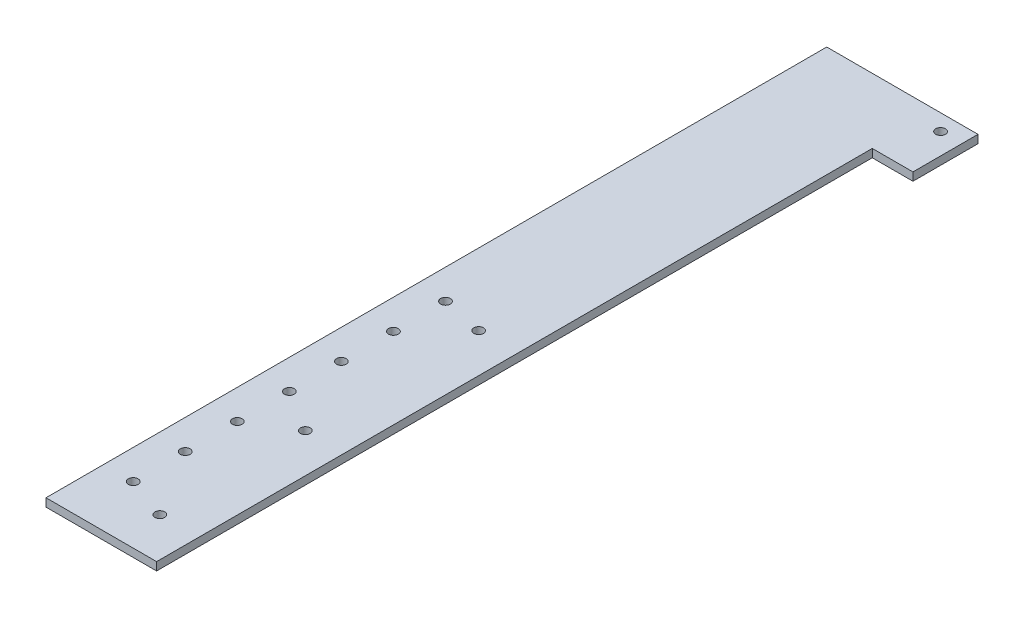
ISO-10303-21;
HEADER;
FILE_DESCRIPTION(('STEP AP214'),'2;1');
FILE_NAME('part.step','',(''),(''),'','','');
FILE_SCHEMA(('AUTOMOTIVE_DESIGN { 1 0 10303 214 1 1 1 1 }'));
ENDSEC;
DATA;
#1=APPLICATION_CONTEXT('core data for automotive mechanical design processes');
#2=APPLICATION_PROTOCOL_DEFINITION('international standard','automotive_design',2000,#1);
#3=PRODUCT_CONTEXT('',#1,'mechanical');
#4=PRODUCT('Part','Part','',(#3));
#5=PRODUCT_RELATED_PRODUCT_CATEGORY('part','',(#4));
#6=PRODUCT_DEFINITION_FORMATION('','',#4);
#7=PRODUCT_DEFINITION_CONTEXT('part definition',#1,'design');
#8=PRODUCT_DEFINITION('design','',#6,#7);
#9=PRODUCT_DEFINITION_SHAPE('','',#8);
#10=(LENGTH_UNIT() NAMED_UNIT(*) SI_UNIT(.MILLI.,.METRE.));
#11=(NAMED_UNIT(*) PLANE_ANGLE_UNIT() SI_UNIT($,.RADIAN.));
#12=(NAMED_UNIT(*) SI_UNIT($,.STERADIAN.) SOLID_ANGLE_UNIT());
#13=UNCERTAINTY_MEASURE_WITH_UNIT(LENGTH_MEASURE(1.E-05),#10,'distance_accuracy_value','');
#14=(GEOMETRIC_REPRESENTATION_CONTEXT(3) GLOBAL_UNCERTAINTY_ASSIGNED_CONTEXT((#13)) GLOBAL_UNIT_ASSIGNED_CONTEXT((#10,
#11,#12)) REPRESENTATION_CONTEXT('',''));
#15=CARTESIAN_POINT('',(0.,0.,0.));
#16=DIRECTION('',(0.,0.,1.));
#17=DIRECTION('',(1.,0.,0.));
#18=AXIS2_PLACEMENT_3D('',#15,#16,#17);
#19=CARTESIAN_POINT('',(0.,3.175,0.));
#20=DIRECTION('',(0.,0.,-1.));
#21=DIRECTION('',(-1.,0.,0.));
#22=AXIS2_PLACEMENT_3D('',#19,#20,#21);
#23=PLANE('',#22);
#24=DIRECTION('',(1.,0.,0.));
#25=VECTOR('',#24,1.);
#26=CARTESIAN_POINT('',(0.,0.,0.));
#27=LINE('',#26,#25);
#28=CARTESIAN_POINT('',(-17.78,0.,0.));
#29=VERTEX_POINT('',#28);
#30=CARTESIAN_POINT('',(25.4,0.,0.));
#31=VERTEX_POINT('',#30);
#32=EDGE_CURVE('E105',#29,#31,#27,.T.);
#33=ORIENTED_EDGE('',*,*,#32,.T.);
#34=DIRECTION('',(0.,-1.,0.));
#35=VECTOR('',#34,1.);
#36=CARTESIAN_POINT('',(25.4,3.175,0.));
#37=LINE('',#36,#35);
#38=CARTESIAN_POINT('',(25.4,3.175,0.));
#39=VERTEX_POINT('',#38);
#40=EDGE_CURVE('E11',#39,#31,#37,.T.);
#41=ORIENTED_EDGE('',*,*,#40,.F.);
#42=DIRECTION('',(1.,0.,0.));
#43=VECTOR('',#42,1.);
#44=CARTESIAN_POINT('',(0.,3.175,0.));
#45=LINE('',#44,#43);
#46=CARTESIAN_POINT('',(-17.78,3.175,0.));
#47=VERTEX_POINT('',#46);
#48=EDGE_CURVE('E79',#47,#39,#45,.T.);
#49=ORIENTED_EDGE('',*,*,#48,.F.);
#50=DIRECTION('',(0.,1.,0.));
#51=VECTOR('',#50,1.);
#52=CARTESIAN_POINT('',(-17.78,0.,0.));
#53=LINE('',#52,#51);
#54=EDGE_CURVE('E109',#29,#47,#53,.T.);
#55=ORIENTED_EDGE('',*,*,#54,.F.);
#56=EDGE_LOOP('',(#33,#41,#49,#55));
#57=FACE_BOUND('',#56,.T.);
#58=ADVANCED_FACE('F35',(#57),#23,.F.);
#59=CARTESIAN_POINT('',(25.4,3.175,0.));
#60=DIRECTION('',(-1.,0.,0.));
#61=DIRECTION('',(0.,0.,1.));
#62=AXIS2_PLACEMENT_3D('',#59,#60,#61);
#63=PLANE('',#62);
#64=DIRECTION('',(0.,0.,-1.));
#65=VECTOR('',#64,1.);
#66=CARTESIAN_POINT('',(25.4,0.,0.));
#67=LINE('',#66,#65);
#68=CARTESIAN_POINT('',(25.4,0.,-279.4));
#69=VERTEX_POINT('',#68);
#70=EDGE_CURVE('E157',#31,#69,#67,.T.);
#71=ORIENTED_EDGE('',*,*,#70,.T.);
#72=DIRECTION('',(0.,-1.,0.));
#73=VECTOR('',#72,1.);
#74=CARTESIAN_POINT('',(25.4,3.175,-279.4));
#75=LINE('',#74,#73);
#76=CARTESIAN_POINT('',(25.4,3.175,-279.4));
#77=VERTEX_POINT('',#76);
#78=EDGE_CURVE('E43',#77,#69,#75,.T.);
#79=ORIENTED_EDGE('',*,*,#78,.F.);
#80=DIRECTION('',(0.,0.,-1.));
#81=VECTOR('',#80,1.);
#82=CARTESIAN_POINT('',(25.4,3.175,0.));
#83=LINE('',#82,#81);
#84=EDGE_CURVE('E148',#39,#77,#83,.T.);
#85=ORIENTED_EDGE('',*,*,#84,.F.);
#86=ORIENTED_EDGE('',*,*,#40,.T.);
#87=EDGE_LOOP('',(#71,#79,#85,#86));
#88=FACE_BOUND('',#87,.T.);
#89=ADVANCED_FACE('F180',(#88),#63,.F.);
#90=CARTESIAN_POINT('',(0.,3.175,-279.4));
#91=DIRECTION('',(0.,0.,-1.));
#92=DIRECTION('',(-1.,0.,0.));
#93=AXIS2_PLACEMENT_3D('',#90,#91,#92);
#94=PLANE('',#93);
#95=DIRECTION('',(1.,0.,0.));
#96=VECTOR('',#95,1.);
#97=CARTESIAN_POINT('',(0.,0.,-279.4));
#98=LINE('',#97,#96);
#99=CARTESIAN_POINT('',(41.275,0.,-279.4));
#100=VERTEX_POINT('',#99);
#101=EDGE_CURVE('E159',#69,#100,#98,.T.);
#102=ORIENTED_EDGE('',*,*,#101,.T.);
#103=DIRECTION('',(0.,-1.,0.));
#104=VECTOR('',#103,1.);
#105=CARTESIAN_POINT('',(41.275,3.175,-279.4));
#106=LINE('',#105,#104);
#107=CARTESIAN_POINT('',(41.275,3.175,-279.4));
#108=VERTEX_POINT('',#107);
#109=EDGE_CURVE('E67',#108,#100,#106,.T.);
#110=ORIENTED_EDGE('',*,*,#109,.F.);
#111=DIRECTION('',(1.,0.,0.));
#112=VECTOR('',#111,1.);
#113=CARTESIAN_POINT('',(0.,3.175,-279.4));
#114=LINE('',#113,#112);
#115=EDGE_CURVE('E150',#77,#108,#114,.T.);
#116=ORIENTED_EDGE('',*,*,#115,.F.);
#117=ORIENTED_EDGE('',*,*,#78,.T.);
#118=EDGE_LOOP('',(#102,#110,#116,#117));
#119=FACE_BOUND('',#118,.T.);
#120=ADVANCED_FACE('F168',(#119),#94,.F.);
#121=CARTESIAN_POINT('',(41.2749999999998,3.175,0.));
#122=DIRECTION('',(1.,0.,0.));
#123=DIRECTION('',(0.,0.,-1.));
#124=AXIS2_PLACEMENT_3D('',#121,#122,#123);
#125=PLANE('',#124);
#126=DIRECTION('',(0.,0.,1.));
#127=VECTOR('',#126,1.);
#128=CARTESIAN_POINT('',(41.2749999999998,0.,0.));
#129=LINE('',#128,#127);
#130=CARTESIAN_POINT('',(41.275,0.,-304.8));
#131=VERTEX_POINT('',#130);
#132=EDGE_CURVE('E99',#131,#100,#129,.T.);
#133=ORIENTED_EDGE('',*,*,#132,.F.);
#134=DIRECTION('',(0.,-1.,0.));
#135=VECTOR('',#134,1.);
#136=CARTESIAN_POINT('',(41.275,3.175,-304.8));
#137=LINE('',#136,#135);
#138=CARTESIAN_POINT('',(41.275,3.175,-304.8));
#139=VERTEX_POINT('',#138);
#140=EDGE_CURVE('E51',#139,#131,#137,.T.);
#141=ORIENTED_EDGE('',*,*,#140,.F.);
#142=DIRECTION('',(0.,0.,1.));
#143=VECTOR('',#142,1.);
#144=CARTESIAN_POINT('',(41.2749999999998,3.175,0.));
#145=LINE('',#144,#143);
#146=EDGE_CURVE('E152',#139,#108,#145,.T.);
#147=ORIENTED_EDGE('',*,*,#146,.T.);
#148=ORIENTED_EDGE('',*,*,#109,.T.);
#149=EDGE_LOOP('',(#133,#141,#147,#148));
#150=FACE_BOUND('',#149,.T.);
#151=ADVANCED_FACE('F171',(#150),#125,.T.);
#152=CARTESIAN_POINT('',(0.,3.175,-304.8));
#153=DIRECTION('',(0.,0.,-1.));
#154=DIRECTION('',(-1.,0.,0.));
#155=AXIS2_PLACEMENT_3D('',#152,#153,#154);
#156=PLANE('',#155);
#157=DIRECTION('',(1.,0.,0.));
#158=VECTOR('',#157,1.);
#159=CARTESIAN_POINT('',(0.,0.,-304.8));
#160=LINE('',#159,#158);
#161=CARTESIAN_POINT('',(-17.78,0.,-304.8));
#162=VERTEX_POINT('',#161);
#163=EDGE_CURVE('E92',#162,#131,#160,.T.);
#164=ORIENTED_EDGE('',*,*,#163,.F.);
#165=DIRECTION('',(0.,-1.,0.));
#166=VECTOR('',#165,1.);
#167=CARTESIAN_POINT('',(-17.78,3.175,-304.8));
#168=LINE('',#167,#166);
#169=CARTESIAN_POINT('',(-17.78,3.175,-304.8));
#170=VERTEX_POINT('',#169);
#171=EDGE_CURVE('E96',#170,#162,#168,.T.);
#172=ORIENTED_EDGE('',*,*,#171,.F.);
#173=DIRECTION('',(1.,0.,0.));
#174=VECTOR('',#173,1.);
#175=CARTESIAN_POINT('',(0.,3.175,-304.8));
#176=LINE('',#175,#174);
#177=EDGE_CURVE('E154',#170,#139,#176,.T.);
#178=ORIENTED_EDGE('',*,*,#177,.T.);
#179=ORIENTED_EDGE('',*,*,#140,.T.);
#180=EDGE_LOOP('',(#164,#172,#178,#179));
#181=FACE_BOUND('',#180,.T.);
#182=ADVANCED_FACE('F94',(#181),#156,.T.);
#183=CARTESIAN_POINT('',(0.,3.175,0.));
#184=DIRECTION('',(0.,1.,0.));
#185=DIRECTION('',(0.,0.,1.));
#186=AXIS2_PLACEMENT_3D('',#183,#184,#185);
#187=PLANE('',#186);
#188=CARTESIAN_POINT('',(-6.22300000000007,3.175,-42.799));
#189=DIRECTION('',(0.,1.,0.));
#190=DIRECTION('',(0.,0.,1.));
#191=AXIS2_PLACEMENT_3D('',#188,#189,#190);
#192=CIRCLE('',#191,1.89865);
#193=CARTESIAN_POINT('',(-6.22300000000007,3.175,-40.90035));
#194=VERTEX_POINT('',#193);
#195=EDGE_CURVE('E250',#194,#194,#192,.T.);
#196=ORIENTED_EDGE('',*,*,#195,.F.);
#197=EDGE_LOOP('',(#196));
#198=FACE_BOUND('',#197,.T.);
#199=CARTESIAN_POINT('',(-6.22300000000014,3.175,-63.119));
#200=DIRECTION('',(0.,1.,0.));
#201=DIRECTION('',(0.,0.,1.));
#202=AXIS2_PLACEMENT_3D('',#199,#200,#201);
#203=CIRCLE('',#202,1.89865);
#204=CARTESIAN_POINT('',(-6.22300000000014,3.175,-61.22035));
#205=VERTEX_POINT('',#204);
#206=EDGE_CURVE('E252',#205,#205,#203,.T.);
#207=ORIENTED_EDGE('',*,*,#206,.F.);
#208=EDGE_LOOP('',(#207));
#209=FACE_BOUND('',#208,.T.);
#210=CARTESIAN_POINT('',(-6.22300000000021,3.175,-83.439));
#211=DIRECTION('',(0.,1.,0.));
#212=DIRECTION('',(0.,0.,1.));
#213=AXIS2_PLACEMENT_3D('',#210,#211,#212);
#214=CIRCLE('',#213,1.89865);
#215=CARTESIAN_POINT('',(-6.22300000000021,3.175,-81.54035));
#216=VERTEX_POINT('',#215);
#217=EDGE_CURVE('E260',#216,#216,#214,.T.);
#218=ORIENTED_EDGE('',*,*,#217,.F.);
#219=EDGE_LOOP('',(#218));
#220=FACE_BOUND('',#219,.T.);
#221=CARTESIAN_POINT('',(-6.22300000000028,3.175,-103.759));
#222=DIRECTION('',(0.,1.,0.));
#223=DIRECTION('',(0.,0.,1.));
#224=AXIS2_PLACEMENT_3D('',#221,#222,#223);
#225=CIRCLE('',#224,1.89865);
#226=CARTESIAN_POINT('',(-6.22300000000028,3.175,-101.86035));
#227=VERTEX_POINT('',#226);
#228=EDGE_CURVE('E266',#227,#227,#225,.T.);
#229=ORIENTED_EDGE('',*,*,#228,.F.);
#230=EDGE_LOOP('',(#229));
#231=FACE_BOUND('',#230,.T.);
#232=CARTESIAN_POINT('',(-6.22300000000035,3.175,-124.079));
#233=DIRECTION('',(0.,1.,0.));
#234=DIRECTION('',(0.,0.,1.));
#235=AXIS2_PLACEMENT_3D('',#232,#233,#234);
#236=CIRCLE('',#235,1.89865);
#237=CARTESIAN_POINT('',(-6.22300000000035,3.175,-122.18035));
#238=VERTEX_POINT('',#237);
#239=EDGE_CURVE('E272',#238,#238,#236,.T.);
#240=ORIENTED_EDGE('',*,*,#239,.F.);
#241=EDGE_LOOP('',(#240));
#242=FACE_BOUND('',#241,.T.);
#243=CARTESIAN_POINT('',(-6.22300000000043,3.175,-144.399));
#244=DIRECTION('',(0.,1.,0.));
#245=DIRECTION('',(0.,0.,1.));
#246=AXIS2_PLACEMENT_3D('',#243,#244,#245);
#247=CIRCLE('',#246,1.89865);
#248=CARTESIAN_POINT('',(-6.22300000000043,3.175,-142.50035));
#249=VERTEX_POINT('',#248);
#250=EDGE_CURVE('E278',#249,#249,#247,.T.);
#251=ORIENTED_EDGE('',*,*,#250,.F.);
#252=EDGE_LOOP('',(#251));
#253=FACE_BOUND('',#252,.T.);
#254=CARTESIAN_POINT('',(-6.223,3.175,-22.479));
#255=DIRECTION('',(0.,1.,0.));
#256=DIRECTION('',(0.,0.,1.));
#257=AXIS2_PLACEMENT_3D('',#254,#255,#256);
#258=CIRCLE('',#257,1.89865);
#259=CARTESIAN_POINT('',(-6.223,3.175,-20.58035));
#260=VERTEX_POINT('',#259);
#261=EDGE_CURVE('E117',#260,#260,#258,.T.);
#262=ORIENTED_EDGE('',*,*,#261,.F.);
#263=EDGE_LOOP('',(#262));
#264=FACE_BOUND('',#263,.T.);
#265=CARTESIAN_POINT('',(10.16,3.175,-16.51));
#266=DIRECTION('',(0.,1.,0.));
#267=DIRECTION('',(0.,0.,1.));
#268=AXIS2_PLACEMENT_3D('',#265,#266,#267);
#269=CIRCLE('',#268,1.89865);
#270=CARTESIAN_POINT('',(10.16,3.175,-14.61135));
#271=VERTEX_POINT('',#270);
#272=EDGE_CURVE('E123',#271,#271,#269,.T.);
#273=ORIENTED_EDGE('',*,*,#272,.F.);
#274=EDGE_LOOP('',(#273));
#275=FACE_BOUND('',#274,.T.);
#276=CARTESIAN_POINT('',(10.16,3.175,-73.3083469776526));
#277=DIRECTION('',(0.,1.,0.));
#278=DIRECTION('',(0.,0.,1.));
#279=AXIS2_PLACEMENT_3D('',#276,#277,#278);
#280=CIRCLE('',#279,1.89865);
#281=CARTESIAN_POINT('',(10.16,3.175,-71.4096969776526));
#282=VERTEX_POINT('',#281);
#283=EDGE_CURVE('E129',#282,#282,#280,.T.);
#284=ORIENTED_EDGE('',*,*,#283,.F.);
#285=EDGE_LOOP('',(#284));
#286=FACE_BOUND('',#285,.T.);
#287=CARTESIAN_POINT('',(10.16,3.175,-140.97));
#288=DIRECTION('',(0.,1.,0.));
#289=DIRECTION('',(0.,0.,1.));
#290=AXIS2_PLACEMENT_3D('',#287,#288,#289);
#291=CIRCLE('',#290,1.89865);
#292=CARTESIAN_POINT('',(10.16,3.175,-139.07135));
#293=VERTEX_POINT('',#292);
#294=EDGE_CURVE('E135',#293,#293,#291,.T.);
#295=ORIENTED_EDGE('',*,*,#294,.F.);
#296=EDGE_LOOP('',(#295));
#297=FACE_BOUND('',#296,.T.);
#298=CARTESIAN_POINT('',(33.02,3.175,-298.45));
#299=DIRECTION('',(0.,1.,0.));
#300=DIRECTION('',(0.,0.,1.));
#301=AXIS2_PLACEMENT_3D('',#298,#299,#300);
#302=CIRCLE('',#301,1.89865);
#303=CARTESIAN_POINT('',(33.02,3.175,-296.55135));
#304=VERTEX_POINT('',#303);
#305=EDGE_CURVE('E141',#304,#304,#302,.T.);
#306=ORIENTED_EDGE('',*,*,#305,.F.);
#307=EDGE_LOOP('',(#306));
#308=FACE_BOUND('',#307,.T.);
#309=ORIENTED_EDGE('',*,*,#177,.F.);
#310=DIRECTION('',(0.,0.,-1.));
#311=VECTOR('',#310,1.);
#312=CARTESIAN_POINT('',(-17.78,3.175,0.));
#313=LINE('',#312,#311);
#314=EDGE_CURVE('E113',#47,#170,#313,.T.);
#315=ORIENTED_EDGE('',*,*,#314,.F.);
#316=ORIENTED_EDGE('',*,*,#48,.T.);
#317=ORIENTED_EDGE('',*,*,#84,.T.);
#318=ORIENTED_EDGE('',*,*,#115,.T.);
#319=ORIENTED_EDGE('',*,*,#146,.F.);
#320=EDGE_LOOP('',(#309,#315,#316,#317,#318,#319));
#321=FACE_BOUND('',#320,.T.);
#322=ADVANCED_FACE('F178',(#198,#209,#220,#231,#242,#253,#264,#275,#286,#297,#308,#321),#187,.T.);
#323=CARTESIAN_POINT('',(0.,0.,0.));
#324=DIRECTION('',(0.,1.,0.));
#325=DIRECTION('',(0.,0.,1.));
#326=AXIS2_PLACEMENT_3D('',#323,#324,#325);
#327=PLANE('',#326);
#328=CARTESIAN_POINT('',(-6.22300000000007,0.,-42.799));
#329=DIRECTION('',(0.,1.,0.));
#330=DIRECTION('',(0.,0.,1.));
#331=AXIS2_PLACEMENT_3D('',#328,#329,#330);
#332=CIRCLE('',#331,1.89865);
#333=CARTESIAN_POINT('',(-6.22300000000007,0.,-40.90035));
#334=VERTEX_POINT('',#333);
#335=EDGE_CURVE('E248',#334,#334,#332,.T.);
#336=ORIENTED_EDGE('',*,*,#335,.T.);
#337=EDGE_LOOP('',(#336));
#338=FACE_BOUND('',#337,.T.);
#339=CARTESIAN_POINT('',(-6.22300000000014,0.,-63.119));
#340=DIRECTION('',(0.,1.,0.));
#341=DIRECTION('',(0.,0.,1.));
#342=AXIS2_PLACEMENT_3D('',#339,#340,#341);
#343=CIRCLE('',#342,1.89865);
#344=CARTESIAN_POINT('',(-6.22300000000014,0.,-61.22035));
#345=VERTEX_POINT('',#344);
#346=EDGE_CURVE('E257',#345,#345,#343,.T.);
#347=ORIENTED_EDGE('',*,*,#346,.T.);
#348=EDGE_LOOP('',(#347));
#349=FACE_BOUND('',#348,.T.);
#350=CARTESIAN_POINT('',(-6.22300000000021,0.,-83.439));
#351=DIRECTION('',(0.,1.,0.));
#352=DIRECTION('',(0.,0.,1.));
#353=AXIS2_PLACEMENT_3D('',#350,#351,#352);
#354=CIRCLE('',#353,1.89865);
#355=CARTESIAN_POINT('',(-6.22300000000021,0.,-81.54035));
#356=VERTEX_POINT('',#355);
#357=EDGE_CURVE('E263',#356,#356,#354,.T.);
#358=ORIENTED_EDGE('',*,*,#357,.T.);
#359=EDGE_LOOP('',(#358));
#360=FACE_BOUND('',#359,.T.);
#361=CARTESIAN_POINT('',(-6.22300000000028,0.,-103.759));
#362=DIRECTION('',(0.,1.,0.));
#363=DIRECTION('',(0.,0.,1.));
#364=AXIS2_PLACEMENT_3D('',#361,#362,#363);
#365=CIRCLE('',#364,1.89865);
#366=CARTESIAN_POINT('',(-6.22300000000028,0.,-101.86035));
#367=VERTEX_POINT('',#366);
#368=EDGE_CURVE('E269',#367,#367,#365,.T.);
#369=ORIENTED_EDGE('',*,*,#368,.T.);
#370=EDGE_LOOP('',(#369));
#371=FACE_BOUND('',#370,.T.);
#372=CARTESIAN_POINT('',(-6.22300000000035,0.,-124.079));
#373=DIRECTION('',(0.,1.,0.));
#374=DIRECTION('',(0.,0.,1.));
#375=AXIS2_PLACEMENT_3D('',#372,#373,#374);
#376=CIRCLE('',#375,1.89865);
#377=CARTESIAN_POINT('',(-6.22300000000035,0.,-122.18035));
#378=VERTEX_POINT('',#377);
#379=EDGE_CURVE('E275',#378,#378,#376,.T.);
#380=ORIENTED_EDGE('',*,*,#379,.T.);
#381=EDGE_LOOP('',(#380));
#382=FACE_BOUND('',#381,.T.);
#383=CARTESIAN_POINT('',(-6.22300000000043,0.,-144.399));
#384=DIRECTION('',(0.,1.,0.));
#385=DIRECTION('',(0.,0.,1.));
#386=AXIS2_PLACEMENT_3D('',#383,#384,#385);
#387=CIRCLE('',#386,1.89865);
#388=CARTESIAN_POINT('',(-6.22300000000043,0.,-142.50035));
#389=VERTEX_POINT('',#388);
#390=EDGE_CURVE('E281',#389,#389,#387,.T.);
#391=ORIENTED_EDGE('',*,*,#390,.T.);
#392=EDGE_LOOP('',(#391));
#393=FACE_BOUND('',#392,.T.);
#394=CARTESIAN_POINT('',(-6.223,0.,-22.479));
#395=DIRECTION('',(0.,1.,0.));
#396=DIRECTION('',(0.,0.,1.));
#397=AXIS2_PLACEMENT_3D('',#394,#395,#396);
#398=CIRCLE('',#397,1.89865);
#399=CARTESIAN_POINT('',(-6.223,0.,-20.58035));
#400=VERTEX_POINT('',#399);
#401=EDGE_CURVE('E114',#400,#400,#398,.T.);
#402=ORIENTED_EDGE('',*,*,#401,.T.);
#403=EDGE_LOOP('',(#402));
#404=FACE_BOUND('',#403,.T.);
#405=CARTESIAN_POINT('',(10.16,0.,-16.51));
#406=DIRECTION('',(0.,1.,0.));
#407=DIRECTION('',(0.,0.,1.));
#408=AXIS2_PLACEMENT_3D('',#405,#406,#407);
#409=CIRCLE('',#408,1.89865);
#410=CARTESIAN_POINT('',(10.16,0.,-14.61135));
#411=VERTEX_POINT('',#410);
#412=EDGE_CURVE('E126',#411,#411,#409,.T.);
#413=ORIENTED_EDGE('',*,*,#412,.T.);
#414=EDGE_LOOP('',(#413));
#415=FACE_BOUND('',#414,.T.);
#416=CARTESIAN_POINT('',(10.16,0.,-73.3083469776526));
#417=DIRECTION('',(0.,1.,0.));
#418=DIRECTION('',(0.,0.,1.));
#419=AXIS2_PLACEMENT_3D('',#416,#417,#418);
#420=CIRCLE('',#419,1.89865);
#421=CARTESIAN_POINT('',(10.16,0.,-71.4096969776526));
#422=VERTEX_POINT('',#421);
#423=EDGE_CURVE('E132',#422,#422,#420,.T.);
#424=ORIENTED_EDGE('',*,*,#423,.T.);
#425=EDGE_LOOP('',(#424));
#426=FACE_BOUND('',#425,.T.);
#427=CARTESIAN_POINT('',(10.16,0.,-140.97));
#428=DIRECTION('',(0.,1.,0.));
#429=DIRECTION('',(0.,0.,1.));
#430=AXIS2_PLACEMENT_3D('',#427,#428,#429);
#431=CIRCLE('',#430,1.89865);
#432=CARTESIAN_POINT('',(10.16,0.,-139.07135));
#433=VERTEX_POINT('',#432);
#434=EDGE_CURVE('E138',#433,#433,#431,.T.);
#435=ORIENTED_EDGE('',*,*,#434,.T.);
#436=EDGE_LOOP('',(#435));
#437=FACE_BOUND('',#436,.T.);
#438=CARTESIAN_POINT('',(33.02,0.,-298.45));
#439=DIRECTION('',(0.,1.,0.));
#440=DIRECTION('',(0.,0.,1.));
#441=AXIS2_PLACEMENT_3D('',#438,#439,#440);
#442=CIRCLE('',#441,1.89865);
#443=CARTESIAN_POINT('',(33.02,0.,-296.55135));
#444=VERTEX_POINT('',#443);
#445=EDGE_CURVE('E144',#444,#444,#442,.T.);
#446=ORIENTED_EDGE('',*,*,#445,.T.);
#447=EDGE_LOOP('',(#446));
#448=FACE_BOUND('',#447,.T.);
#449=ORIENTED_EDGE('',*,*,#32,.F.);
#450=DIRECTION('',(0.,0.,1.));
#451=VECTOR('',#450,1.);
#452=CARTESIAN_POINT('',(-17.78,0.,-304.8));
#453=LINE('',#452,#451);
#454=EDGE_CURVE('E102',#162,#29,#453,.T.);
#455=ORIENTED_EDGE('',*,*,#454,.F.);
#456=ORIENTED_EDGE('',*,*,#163,.T.);
#457=ORIENTED_EDGE('',*,*,#132,.T.);
#458=ORIENTED_EDGE('',*,*,#101,.F.);
#459=ORIENTED_EDGE('',*,*,#70,.F.);
#460=EDGE_LOOP('',(#449,#455,#456,#457,#458,#459));
#461=FACE_BOUND('',#460,.T.);
#462=ADVANCED_FACE('F103',(#338,#349,#360,#371,#382,#393,#404,#415,#426,#437,#448,#461),#327,.F.);
#463=CARTESIAN_POINT('',(33.02,3.175,-298.45));
#464=DIRECTION('',(0.,1.,0.));
#465=DIRECTION('',(0.,0.,1.));
#466=AXIS2_PLACEMENT_3D('',#463,#464,#465);
#467=CYLINDRICAL_SURFACE('',#466,1.89865);
#468=ORIENTED_EDGE('',*,*,#445,.F.);
#469=EDGE_LOOP('',(#468));
#470=FACE_BOUND('',#469,.T.);
#471=ORIENTED_EDGE('',*,*,#305,.T.);
#472=EDGE_LOOP('',(#471));
#473=FACE_BOUND('',#472,.T.);
#474=ADVANCED_FACE('F193',(#470,#473),#467,.F.);
#475=CARTESIAN_POINT('',(10.16,3.175,-140.97));
#476=DIRECTION('',(0.,1.,0.));
#477=DIRECTION('',(0.,0.,1.));
#478=AXIS2_PLACEMENT_3D('',#475,#476,#477);
#479=CYLINDRICAL_SURFACE('',#478,1.89865);
#480=ORIENTED_EDGE('',*,*,#434,.F.);
#481=EDGE_LOOP('',(#480));
#482=FACE_BOUND('',#481,.T.);
#483=ORIENTED_EDGE('',*,*,#294,.T.);
#484=EDGE_LOOP('',(#483));
#485=FACE_BOUND('',#484,.T.);
#486=ADVANCED_FACE('F201',(#482,#485),#479,.F.);
#487=CARTESIAN_POINT('',(10.16,3.175,-73.3083469776526));
#488=DIRECTION('',(0.,1.,0.));
#489=DIRECTION('',(0.,0.,1.));
#490=AXIS2_PLACEMENT_3D('',#487,#488,#489);
#491=CYLINDRICAL_SURFACE('',#490,1.89865);
#492=ORIENTED_EDGE('',*,*,#423,.F.);
#493=EDGE_LOOP('',(#492));
#494=FACE_BOUND('',#493,.T.);
#495=ORIENTED_EDGE('',*,*,#283,.T.);
#496=EDGE_LOOP('',(#495));
#497=FACE_BOUND('',#496,.T.);
#498=ADVANCED_FACE('F205',(#494,#497),#491,.F.);
#499=CARTESIAN_POINT('',(10.16,3.175,-16.51));
#500=DIRECTION('',(0.,1.,0.));
#501=DIRECTION('',(0.,0.,1.));
#502=AXIS2_PLACEMENT_3D('',#499,#500,#501);
#503=CYLINDRICAL_SURFACE('',#502,1.89865);
#504=ORIENTED_EDGE('',*,*,#412,.F.);
#505=EDGE_LOOP('',(#504));
#506=FACE_BOUND('',#505,.T.);
#507=ORIENTED_EDGE('',*,*,#272,.T.);
#508=EDGE_LOOP('',(#507));
#509=FACE_BOUND('',#508,.T.);
#510=ADVANCED_FACE('F209',(#506,#509),#503,.F.);
#511=CARTESIAN_POINT('',(-17.78,0.,0.));
#512=DIRECTION('',(-1.,0.,0.));
#513=DIRECTION('',(0.,0.,1.));
#514=AXIS2_PLACEMENT_3D('',#511,#512,#513);
#515=PLANE('',#514);
#516=ORIENTED_EDGE('',*,*,#171,.T.);
#517=ORIENTED_EDGE('',*,*,#454,.T.);
#518=ORIENTED_EDGE('',*,*,#54,.T.);
#519=ORIENTED_EDGE('',*,*,#314,.T.);
#520=EDGE_LOOP('',(#516,#517,#518,#519));
#521=FACE_BOUND('',#520,.T.);
#522=ADVANCED_FACE('F112',(#521),#515,.T.);
#523=CARTESIAN_POINT('',(-6.223,3.175,-22.479));
#524=DIRECTION('',(0.,1.,0.));
#525=DIRECTION('',(0.,0.,1.));
#526=AXIS2_PLACEMENT_3D('',#523,#524,#525);
#527=CYLINDRICAL_SURFACE('',#526,1.89865);
#528=ORIENTED_EDGE('',*,*,#401,.F.);
#529=EDGE_LOOP('',(#528));
#530=FACE_BOUND('',#529,.T.);
#531=ORIENTED_EDGE('',*,*,#261,.T.);
#532=EDGE_LOOP('',(#531));
#533=FACE_BOUND('',#532,.T.);
#534=ADVANCED_FACE('F216',(#530,#533),#527,.F.);
#535=CARTESIAN_POINT('',(-6.22300000000043,3.175,-144.399));
#536=DIRECTION('',(0.,1.,0.));
#537=DIRECTION('',(0.,0.,1.));
#538=AXIS2_PLACEMENT_3D('',#535,#536,#537);
#539=CYLINDRICAL_SURFACE('',#538,1.89865);
#540=ORIENTED_EDGE('',*,*,#390,.F.);
#541=EDGE_LOOP('',(#540));
#542=FACE_BOUND('',#541,.T.);
#543=ORIENTED_EDGE('',*,*,#250,.T.);
#544=EDGE_LOOP('',(#543));
#545=FACE_BOUND('',#544,.T.);
#546=ADVANCED_FACE('F219',(#542,#545),#539,.F.);
#547=CARTESIAN_POINT('',(-6.22300000000035,3.175,-124.079));
#548=DIRECTION('',(0.,1.,0.));
#549=DIRECTION('',(0.,0.,1.));
#550=AXIS2_PLACEMENT_3D('',#547,#548,#549);
#551=CYLINDRICAL_SURFACE('',#550,1.89865);
#552=ORIENTED_EDGE('',*,*,#379,.F.);
#553=EDGE_LOOP('',(#552));
#554=FACE_BOUND('',#553,.T.);
#555=ORIENTED_EDGE('',*,*,#239,.T.);
#556=EDGE_LOOP('',(#555));
#557=FACE_BOUND('',#556,.T.);
#558=ADVANCED_FACE('F223',(#554,#557),#551,.F.);
#559=CARTESIAN_POINT('',(-6.22300000000028,3.175,-103.759));
#560=DIRECTION('',(0.,1.,0.));
#561=DIRECTION('',(0.,0.,1.));
#562=AXIS2_PLACEMENT_3D('',#559,#560,#561);
#563=CYLINDRICAL_SURFACE('',#562,1.89865);
#564=ORIENTED_EDGE('',*,*,#368,.F.);
#565=EDGE_LOOP('',(#564));
#566=FACE_BOUND('',#565,.T.);
#567=ORIENTED_EDGE('',*,*,#228,.T.);
#568=EDGE_LOOP('',(#567));
#569=FACE_BOUND('',#568,.T.);
#570=ADVANCED_FACE('F227',(#566,#569),#563,.F.);
#571=CARTESIAN_POINT('',(-6.22300000000021,3.175,-83.439));
#572=DIRECTION('',(0.,1.,0.));
#573=DIRECTION('',(0.,0.,1.));
#574=AXIS2_PLACEMENT_3D('',#571,#572,#573);
#575=CYLINDRICAL_SURFACE('',#574,1.89865);
#576=ORIENTED_EDGE('',*,*,#357,.F.);
#577=EDGE_LOOP('',(#576));
#578=FACE_BOUND('',#577,.T.);
#579=ORIENTED_EDGE('',*,*,#217,.T.);
#580=EDGE_LOOP('',(#579));
#581=FACE_BOUND('',#580,.T.);
#582=ADVANCED_FACE('F231',(#578,#581),#575,.F.);
#583=CARTESIAN_POINT('',(-6.22300000000014,3.175,-63.119));
#584=DIRECTION('',(0.,1.,0.));
#585=DIRECTION('',(0.,0.,1.));
#586=AXIS2_PLACEMENT_3D('',#583,#584,#585);
#587=CYLINDRICAL_SURFACE('',#586,1.89865);
#588=ORIENTED_EDGE('',*,*,#346,.F.);
#589=EDGE_LOOP('',(#588));
#590=FACE_BOUND('',#589,.T.);
#591=ORIENTED_EDGE('',*,*,#206,.T.);
#592=EDGE_LOOP('',(#591));
#593=FACE_BOUND('',#592,.T.);
#594=ADVANCED_FACE('F235',(#590,#593),#587,.F.);
#595=CARTESIAN_POINT('',(-6.22300000000007,3.175,-42.799));
#596=DIRECTION('',(0.,1.,0.));
#597=DIRECTION('',(0.,0.,1.));
#598=AXIS2_PLACEMENT_3D('',#595,#596,#597);
#599=CYLINDRICAL_SURFACE('',#598,1.89865);
#600=ORIENTED_EDGE('',*,*,#335,.F.);
#601=EDGE_LOOP('',(#600));
#602=FACE_BOUND('',#601,.T.);
#603=ORIENTED_EDGE('',*,*,#195,.T.);
#604=EDGE_LOOP('',(#603));
#605=FACE_BOUND('',#604,.T.);
#606=ADVANCED_FACE('F239',(#602,#605),#599,.F.);
#607=CLOSED_SHELL('',(#58,#89,#120,#151,#182,#322,#462,#474,#486,#498,#510,#522,#534,#546,#558,
#570,#582,#594,#606));
#608=MANIFOLD_SOLID_BREP('B2',#607);
#609=ADVANCED_BREP_SHAPE_REPRESENTATION('',(#18,#608),#14);
#610=SHAPE_DEFINITION_REPRESENTATION(#9,#609);
ENDSEC;
END-ISO-10303-21;
